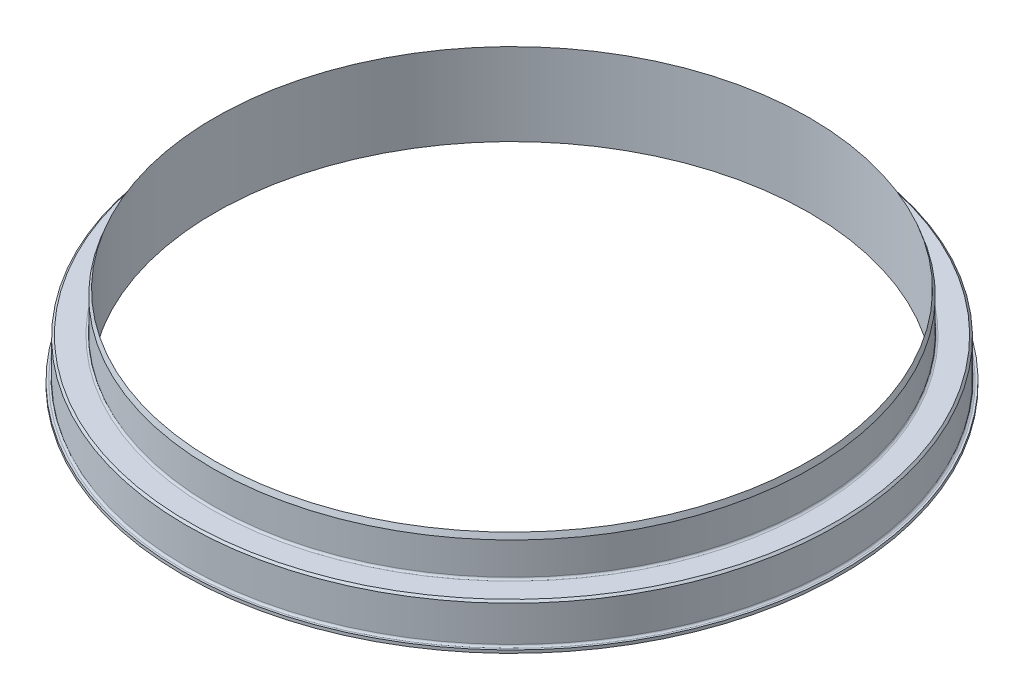
ISO-10303-21;
HEADER;
FILE_DESCRIPTION(('STEP AP214'),'2;1');
FILE_NAME('part.step','',(''),(''),'','','');
FILE_SCHEMA(('AUTOMOTIVE_DESIGN { 1 0 10303 214 1 1 1 1 }'));
ENDSEC;
DATA;
#1=APPLICATION_CONTEXT('core data for automotive mechanical design processes');
#2=APPLICATION_PROTOCOL_DEFINITION('international standard','automotive_design',2000,#1);
#3=PRODUCT_CONTEXT('',#1,'mechanical');
#4=PRODUCT('Part','Part','',(#3));
#5=PRODUCT_RELATED_PRODUCT_CATEGORY('part','',(#4));
#6=PRODUCT_DEFINITION_FORMATION('','',#4);
#7=PRODUCT_DEFINITION_CONTEXT('part definition',#1,'design');
#8=PRODUCT_DEFINITION('design','',#6,#7);
#9=PRODUCT_DEFINITION_SHAPE('','',#8);
#10=(LENGTH_UNIT() NAMED_UNIT(*) SI_UNIT(.MILLI.,.METRE.));
#11=(NAMED_UNIT(*) PLANE_ANGLE_UNIT() SI_UNIT($,.RADIAN.));
#12=(NAMED_UNIT(*) SI_UNIT($,.STERADIAN.) SOLID_ANGLE_UNIT());
#13=UNCERTAINTY_MEASURE_WITH_UNIT(LENGTH_MEASURE(1.E-05),#10,'distance_accuracy_value','');
#14=(GEOMETRIC_REPRESENTATION_CONTEXT(3) GLOBAL_UNCERTAINTY_ASSIGNED_CONTEXT((#13)) GLOBAL_UNIT_ASSIGNED_CONTEXT((#10,
#11,#12)) REPRESENTATION_CONTEXT('',''));
#15=CARTESIAN_POINT('',(0.,0.,0.));
#16=DIRECTION('',(0.,0.,1.));
#17=DIRECTION('',(1.,0.,0.));
#18=AXIS2_PLACEMENT_3D('',#15,#16,#17);
#19=CARTESIAN_POINT('',(0.,19.6862814709171,0.));
#20=DIRECTION('',(0.,-1.,0.));
#21=DIRECTION('',(0.,0.,-1.));
#22=AXIS2_PLACEMENT_3D('',#19,#20,#21);
#23=CONICAL_SURFACE('',#22,76.708,0.349065850398868);
#24=CARTESIAN_POINT('',(0.,21.082,0.));
#25=DIRECTION('',(0.,1.,0.));
#26=DIRECTION('',(0.,0.,1.));
#27=AXIS2_PLACEMENT_3D('',#24,#25,#26);
#28=CIRCLE('',#27,76.2);
#29=CARTESIAN_POINT('',(0.,21.082,76.2));
#30=VERTEX_POINT('',#29);
#31=EDGE_CURVE('E69',#30,#30,#28,.T.);
#32=ORIENTED_EDGE('',*,*,#31,.F.);
#33=EDGE_LOOP('',(#32));
#34=FACE_BOUND('',#33,.T.);
#35=CARTESIAN_POINT('',(0.,19.6862814709171,0.));
#36=DIRECTION('',(0.,1.,0.));
#37=DIRECTION('',(0.,0.,1.));
#38=AXIS2_PLACEMENT_3D('',#35,#36,#37);
#39=CIRCLE('',#38,76.708);
#40=CARTESIAN_POINT('',(0.,19.6862814709171,76.708));
#41=VERTEX_POINT('',#40);
#42=EDGE_CURVE('E57',#41,#41,#39,.T.);
#43=ORIENTED_EDGE('',*,*,#42,.T.);
#44=EDGE_LOOP('',(#43));
#45=FACE_BOUND('',#44,.T.);
#46=ADVANCED_FACE('F31',(#34,#45),#23,.T.);
#47=CARTESIAN_POINT('',(0.,28.7389565787011,0.));
#48=DIRECTION('',(0.,1.,0.));
#49=DIRECTION('',(0.,0.,1.));
#50=AXIS2_PLACEMENT_3D('',#47,#48,#49);
#51=CYLINDRICAL_SURFACE('',#50,76.708);
#52=CARTESIAN_POINT('',(0.,11.43,0.));
#53=DIRECTION('',(0.,-1.,0.));
#54=DIRECTION('',(0.,0.,-1.));
#55=AXIS2_PLACEMENT_3D('',#52,#53,#54);
#56=CIRCLE('',#55,76.708);
#57=CARTESIAN_POINT('',(0.,11.43,-76.708));
#58=VERTEX_POINT('',#57);
#59=EDGE_CURVE('E46',#58,#58,#56,.F.);
#60=ORIENTED_EDGE('',*,*,#59,.T.);
#61=EDGE_LOOP('',(#60));
#62=FACE_BOUND('',#61,.T.);
#63=ORIENTED_EDGE('',*,*,#42,.F.);
#64=EDGE_LOOP('',(#63));
#65=FACE_BOUND('',#64,.T.);
#66=ADVANCED_FACE('F77',(#62,#65),#51,.T.);
#67=CARTESIAN_POINT('',(83.439,10.922,0.));
#68=DIRECTION('',(0.,-1.,0.));
#69=DIRECTION('',(0.,0.,-1.));
#70=AXIS2_PLACEMENT_3D('',#67,#68,#69);
#71=PLANE('',#70);
#72=CARTESIAN_POINT('',(0.,10.922,0.));
#73=DIRECTION('',(0.,-1.,0.));
#74=DIRECTION('',(0.,0.,-1.));
#75=AXIS2_PLACEMENT_3D('',#72,#73,#74);
#76=CIRCLE('',#75,82.931);
#77=CARTESIAN_POINT('',(0.,10.922,-82.931));
#78=VERTEX_POINT('',#77);
#79=EDGE_CURVE('E38',#78,#78,#76,.F.);
#80=ORIENTED_EDGE('',*,*,#79,.T.);
#81=EDGE_LOOP('',(#80));
#82=FACE_BOUND('',#81,.T.);
#83=CARTESIAN_POINT('',(0.,10.922,0.));
#84=DIRECTION('',(0.,-1.,0.));
#85=DIRECTION('',(0.,0.,-1.));
#86=AXIS2_PLACEMENT_3D('',#83,#84,#85);
#87=CIRCLE('',#86,77.216);
#88=CARTESIAN_POINT('',(0.,10.922,-77.216));
#89=VERTEX_POINT('',#88);
#90=EDGE_CURVE('E42',#89,#89,#87,.T.);
#91=ORIENTED_EDGE('',*,*,#90,.T.);
#92=EDGE_LOOP('',(#91));
#93=FACE_BOUND('',#92,.T.);
#94=ADVANCED_FACE('F82',(#82,#93),#71,.F.);
#95=CARTESIAN_POINT('',(0.,28.7389565787011,0.));
#96=DIRECTION('',(0.,1.,0.));
#97=DIRECTION('',(0.,0.,1.));
#98=AXIS2_PLACEMENT_3D('',#95,#96,#97);
#99=CYLINDRICAL_SURFACE('',#98,83.439);
#100=CARTESIAN_POINT('',(0.,10.414,0.));
#101=DIRECTION('',(0.,-1.,0.));
#102=DIRECTION('',(0.,0.,-1.));
#103=AXIS2_PLACEMENT_3D('',#100,#101,#102);
#104=CIRCLE('',#103,83.439);
#105=CARTESIAN_POINT('',(0.,10.414,-83.439));
#106=VERTEX_POINT('',#105);
#107=EDGE_CURVE('E10',#106,#106,#104,.T.);
#108=ORIENTED_EDGE('',*,*,#107,.T.);
#109=EDGE_LOOP('',(#108));
#110=FACE_BOUND('',#109,.T.);
#111=CARTESIAN_POINT('',(0.,1.26999999999999,0.));
#112=DIRECTION('',(0.,-1.,0.));
#113=DIRECTION('',(0.,0.,-1.));
#114=AXIS2_PLACEMENT_3D('',#111,#112,#113);
#115=CIRCLE('',#114,83.439);
#116=CARTESIAN_POINT('',(0.,1.26999999999999,-83.439));
#117=VERTEX_POINT('',#116);
#118=EDGE_CURVE('E54',#117,#117,#115,.F.);
#119=ORIENTED_EDGE('',*,*,#118,.T.);
#120=EDGE_LOOP('',(#119));
#121=FACE_BOUND('',#120,.T.);
#122=ADVANCED_FACE('F88',(#110,#121),#99,.T.);
#123=CARTESIAN_POINT('',(83.439,0.76199999999999,0.));
#124=DIRECTION('',(0.,-1.,0.));
#125=DIRECTION('',(0.,0.,-1.));
#126=AXIS2_PLACEMENT_3D('',#123,#124,#125);
#127=PLANE('',#126);
#128=CARTESIAN_POINT('',(0.,0.76199999999999,0.));
#129=DIRECTION('',(0.,-1.,0.));
#130=DIRECTION('',(0.,0.,-1.));
#131=AXIS2_PLACEMENT_3D('',#128,#129,#130);
#132=CIRCLE('',#131,83.947);
#133=CARTESIAN_POINT('',(0.,0.76199999999999,-83.947));
#134=VERTEX_POINT('',#133);
#135=EDGE_CURVE('E51',#134,#134,#132,.T.);
#136=ORIENTED_EDGE('',*,*,#135,.T.);
#137=EDGE_LOOP('',(#136));
#138=FACE_BOUND('',#137,.T.);
#139=CARTESIAN_POINT('',(0.,0.761999999999985,0.));
#140=DIRECTION('',(0.,1.,0.));
#141=DIRECTION('',(0.,0.,1.));
#142=AXIS2_PLACEMENT_3D('',#139,#140,#141);
#143=CIRCLE('',#142,84.455);
#144=CARTESIAN_POINT('',(0.,0.761999999999985,84.455));
#145=VERTEX_POINT('',#144);
#146=EDGE_CURVE('E60',#145,#145,#143,.T.);
#147=ORIENTED_EDGE('',*,*,#146,.T.);
#148=EDGE_LOOP('',(#147));
#149=FACE_BOUND('',#148,.T.);
#150=ADVANCED_FACE('F119',(#138,#149),#127,.F.);
#151=CARTESIAN_POINT('',(0.,28.7389565787011,0.));
#152=DIRECTION('',(0.,1.,0.));
#153=DIRECTION('',(0.,0.,1.));
#154=AXIS2_PLACEMENT_3D('',#151,#152,#153);
#155=CYLINDRICAL_SURFACE('',#154,84.455);
#156=ORIENTED_EDGE('',*,*,#146,.F.);
#157=EDGE_LOOP('',(#156));
#158=FACE_BOUND('',#157,.T.);
#159=CARTESIAN_POINT('',(0.,0.,0.));
#160=DIRECTION('',(0.,1.,0.));
#161=DIRECTION('',(0.,0.,1.));
#162=AXIS2_PLACEMENT_3D('',#159,#160,#161);
#163=CIRCLE('',#162,84.455);
#164=CARTESIAN_POINT('',(0.,0.,84.455));
#165=VERTEX_POINT('',#164);
#166=EDGE_CURVE('E63',#165,#165,#163,.T.);
#167=ORIENTED_EDGE('',*,*,#166,.T.);
#168=EDGE_LOOP('',(#167));
#169=FACE_BOUND('',#168,.T.);
#170=ADVANCED_FACE('F144',(#158,#169),#155,.T.);
#171=CARTESIAN_POINT('',(76.2,0.,0.));
#172=DIRECTION('',(0.,1.,0.));
#173=DIRECTION('',(0.,0.,1.));
#174=AXIS2_PLACEMENT_3D('',#171,#172,#173);
#175=PLANE('',#174);
#176=ORIENTED_EDGE('',*,*,#166,.F.);
#177=EDGE_LOOP('',(#176));
#178=FACE_BOUND('',#177,.T.);
#179=CARTESIAN_POINT('',(0.,0.,0.));
#180=DIRECTION('',(0.,1.,0.));
#181=DIRECTION('',(0.,0.,1.));
#182=AXIS2_PLACEMENT_3D('',#179,#180,#181);
#183=CIRCLE('',#182,76.2);
#184=CARTESIAN_POINT('',(0.,0.,76.2));
#185=VERTEX_POINT('',#184);
#186=EDGE_CURVE('E66',#185,#185,#183,.T.);
#187=ORIENTED_EDGE('',*,*,#186,.T.);
#188=EDGE_LOOP('',(#187));
#189=FACE_BOUND('',#188,.T.);
#190=ADVANCED_FACE('F159',(#178,#189),#175,.F.);
#191=CARTESIAN_POINT('',(0.,28.7389565787011,0.));
#192=DIRECTION('',(0.,1.,0.));
#193=DIRECTION('',(0.,0.,1.));
#194=AXIS2_PLACEMENT_3D('',#191,#192,#193);
#195=CYLINDRICAL_SURFACE('',#194,76.2);
#196=ORIENTED_EDGE('',*,*,#186,.F.);
#197=EDGE_LOOP('',(#196));
#198=FACE_BOUND('',#197,.T.);
#199=ORIENTED_EDGE('',*,*,#31,.T.);
#200=EDGE_LOOP('',(#199));
#201=FACE_BOUND('',#200,.T.);
#202=ADVANCED_FACE('F73',(#198,#201),#195,.F.);
#203=CARTESIAN_POINT('',(0.,1.26999999999999,0.));
#204=DIRECTION('',(0.,-1.,0.));
#205=DIRECTION('',(0.,0.,-1.));
#206=AXIS2_PLACEMENT_3D('',#203,#204,#205);
#207=TOROIDAL_SURFACE('',#206,83.947,0.508);
#208=ORIENTED_EDGE('',*,*,#135,.F.);
#209=EDGE_LOOP('',(#208));
#210=FACE_BOUND('',#209,.T.);
#211=ORIENTED_EDGE('',*,*,#118,.F.);
#212=EDGE_LOOP('',(#211));
#213=FACE_BOUND('',#212,.T.);
#214=ADVANCED_FACE('F92',(#210,#213),#207,.F.);
#215=CARTESIAN_POINT('',(0.,11.43,0.));
#216=DIRECTION('',(0.,-1.,0.));
#217=DIRECTION('',(0.,0.,-1.));
#218=AXIS2_PLACEMENT_3D('',#215,#216,#217);
#219=TOROIDAL_SURFACE('',#218,77.216,0.508);
#220=ORIENTED_EDGE('',*,*,#90,.F.);
#221=EDGE_LOOP('',(#220));
#222=FACE_BOUND('',#221,.T.);
#223=ORIENTED_EDGE('',*,*,#59,.F.);
#224=EDGE_LOOP('',(#223));
#225=FACE_BOUND('',#224,.T.);
#226=ADVANCED_FACE('F94',(#222,#225),#219,.F.);
#227=CARTESIAN_POINT('',(0.,10.922,0.));
#228=DIRECTION('',(0.,-1.,0.));
#229=DIRECTION('',(0.,0.,-1.));
#230=AXIS2_PLACEMENT_3D('',#227,#228,#229);
#231=CONICAL_SURFACE('',#230,82.931,0.785398163397435);
#232=ORIENTED_EDGE('',*,*,#107,.F.);
#233=EDGE_LOOP('',(#232));
#234=FACE_BOUND('',#233,.T.);
#235=ORIENTED_EDGE('',*,*,#79,.F.);
#236=EDGE_LOOP('',(#235));
#237=FACE_BOUND('',#236,.T.);
#238=ADVANCED_FACE('F33',(#234,#237),#231,.T.);
#239=CLOSED_SHELL('',(#46,#66,#94,#122,#150,#170,#190,#202,#214,#226,#238));
#240=MANIFOLD_SOLID_BREP('B2',#239);
#241=ADVANCED_BREP_SHAPE_REPRESENTATION('',(#18,#240),#14);
#242=SHAPE_DEFINITION_REPRESENTATION(#9,#241);
ENDSEC;
END-ISO-10303-21;
